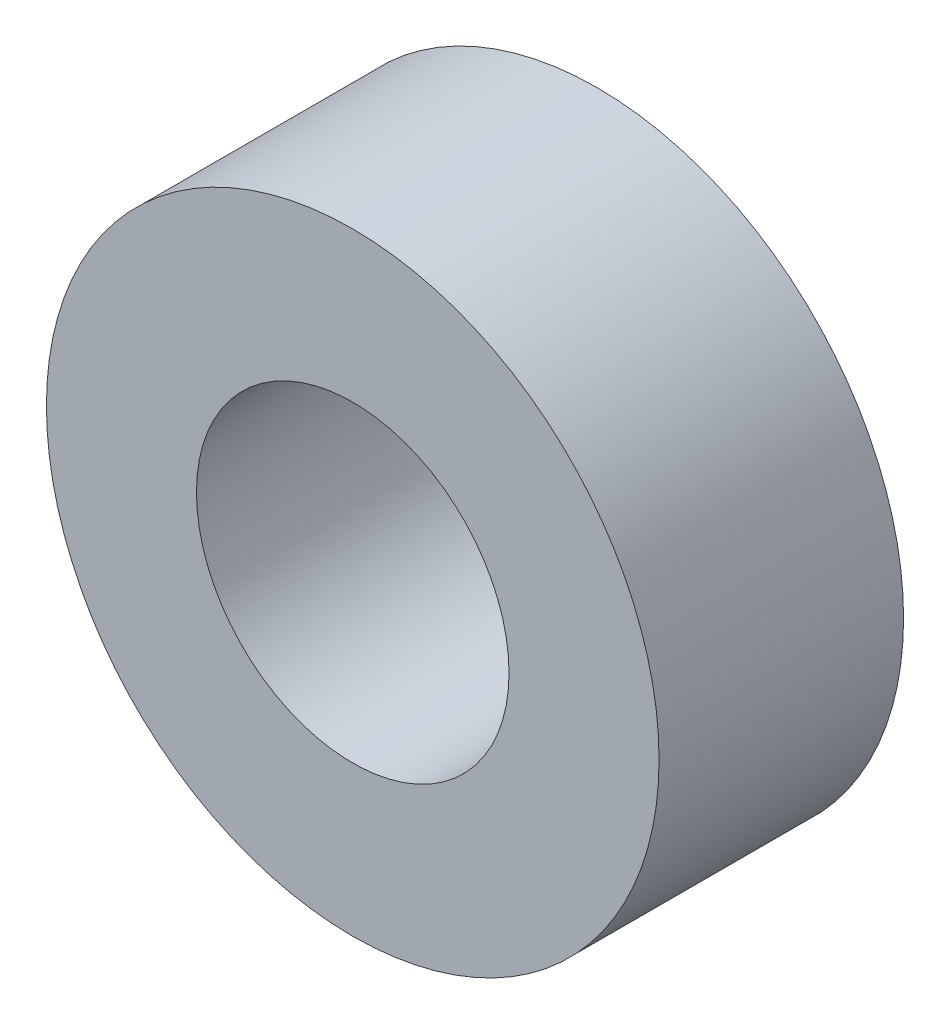
ISO-10303-21;
HEADER;
FILE_DESCRIPTION(('STEP AP214'),'2;1');
FILE_NAME('part.step','',(''),(''),'','','');
FILE_SCHEMA(('AUTOMOTIVE_DESIGN { 1 0 10303 214 1 1 1 1 }'));
ENDSEC;
DATA;
#1=APPLICATION_CONTEXT('core data for automotive mechanical design processes');
#2=APPLICATION_PROTOCOL_DEFINITION('international standard','automotive_design',2000,#1);
#3=PRODUCT_CONTEXT('',#1,'mechanical');
#4=PRODUCT('Part','Part','',(#3));
#5=PRODUCT_RELATED_PRODUCT_CATEGORY('part','',(#4));
#6=PRODUCT_DEFINITION_FORMATION('','',#4);
#7=PRODUCT_DEFINITION_CONTEXT('part definition',#1,'design');
#8=PRODUCT_DEFINITION('design','',#6,#7);
#9=PRODUCT_DEFINITION_SHAPE('','',#8);
#10=(LENGTH_UNIT() NAMED_UNIT(*) SI_UNIT(.MILLI.,.METRE.));
#11=(NAMED_UNIT(*) PLANE_ANGLE_UNIT() SI_UNIT($,.RADIAN.));
#12=(NAMED_UNIT(*) SI_UNIT($,.STERADIAN.) SOLID_ANGLE_UNIT());
#13=UNCERTAINTY_MEASURE_WITH_UNIT(LENGTH_MEASURE(1.E-05),#10,'distance_accuracy_value','');
#14=(GEOMETRIC_REPRESENTATION_CONTEXT(3) GLOBAL_UNCERTAINTY_ASSIGNED_CONTEXT((#13)) GLOBAL_UNIT_ASSIGNED_CONTEXT((#10,
#11,#12)) REPRESENTATION_CONTEXT('',''));
#15=CARTESIAN_POINT('',(0.,0.,0.));
#16=DIRECTION('',(0.,0.,1.));
#17=DIRECTION('',(1.,0.,0.));
#18=AXIS2_PLACEMENT_3D('',#15,#16,#17);
#19=CARTESIAN_POINT('',(0.,0.,7.450808568));
#20=DIRECTION('',(0.,0.,1.));
#21=DIRECTION('',(1.,0.,0.));
#22=AXIS2_PLACEMENT_3D('',#19,#20,#21);
#23=PLANE('',#22);
#24=CARTESIAN_POINT('',(0.,0.,7.450808568));
#25=DIRECTION('',(0.,0.,1.));
#26=DIRECTION('',(1.,0.,0.));
#27=AXIS2_PLACEMENT_3D('',#24,#25,#26);
#28=CIRCLE('',#27,18.669);
#29=CARTESIAN_POINT('',(18.669,0.,7.450808568));
#30=VERTEX_POINT('',#29);
#31=EDGE_CURVE('E12',#30,#30,#28,.T.);
#32=ORIENTED_EDGE('',*,*,#31,.T.);
#33=EDGE_LOOP('',(#32));
#34=FACE_BOUND('',#33,.T.);
#35=CARTESIAN_POINT('',(0.,0.,7.450808568));
#36=DIRECTION('',(0.,0.,1.));
#37=DIRECTION('',(1.,0.,0.));
#38=AXIS2_PLACEMENT_3D('',#35,#36,#37);
#39=CIRCLE('',#38,9.525);
#40=CARTESIAN_POINT('',(9.525,0.,7.450808568));
#41=VERTEX_POINT('',#40);
#42=EDGE_CURVE('E53',#41,#41,#39,.T.);
#43=ORIENTED_EDGE('',*,*,#42,.F.);
#44=EDGE_LOOP('',(#43));
#45=FACE_BOUND('',#44,.T.);
#46=ADVANCED_FACE('F42',(#34,#45),#23,.T.);
#47=CARTESIAN_POINT('',(0.,0.,-7.450808568));
#48=DIRECTION('',(0.,0.,1.));
#49=DIRECTION('',(1.,0.,0.));
#50=AXIS2_PLACEMENT_3D('',#47,#48,#49);
#51=PLANE('',#50);
#52=CARTESIAN_POINT('',(0.,0.,-7.450808568));
#53=DIRECTION('',(0.,0.,1.));
#54=DIRECTION('',(1.,0.,0.));
#55=AXIS2_PLACEMENT_3D('',#52,#53,#54);
#56=CIRCLE('',#55,18.669);
#57=CARTESIAN_POINT('',(18.669,0.,-7.450808568));
#58=VERTEX_POINT('',#57);
#59=EDGE_CURVE('E46',#58,#58,#56,.T.);
#60=ORIENTED_EDGE('',*,*,#59,.F.);
#61=EDGE_LOOP('',(#60));
#62=FACE_BOUND('',#61,.T.);
#63=CARTESIAN_POINT('',(0.,0.,-7.450808568));
#64=DIRECTION('',(0.,0.,1.));
#65=DIRECTION('',(1.,0.,0.));
#66=AXIS2_PLACEMENT_3D('',#63,#64,#65);
#67=CIRCLE('',#66,9.525);
#68=CARTESIAN_POINT('',(9.525,0.,-7.450808568));
#69=VERTEX_POINT('',#68);
#70=EDGE_CURVE('E55',#69,#69,#67,.T.);
#71=ORIENTED_EDGE('',*,*,#70,.T.);
#72=EDGE_LOOP('',(#71));
#73=FACE_BOUND('',#72,.T.);
#74=ADVANCED_FACE('F65',(#62,#73),#51,.F.);
#75=CARTESIAN_POINT('',(0.,0.,7.450808568));
#76=DIRECTION('',(0.,0.,-1.));
#77=DIRECTION('',(-1.,0.,0.));
#78=AXIS2_PLACEMENT_3D('',#75,#76,#77);
#79=CYLINDRICAL_SURFACE('',#78,18.669);
#80=ORIENTED_EDGE('',*,*,#31,.F.);
#81=EDGE_LOOP('',(#80));
#82=FACE_BOUND('',#81,.T.);
#83=ORIENTED_EDGE('',*,*,#59,.T.);
#84=EDGE_LOOP('',(#83));
#85=FACE_BOUND('',#84,.T.);
#86=ADVANCED_FACE('F44',(#82,#85),#79,.T.);
#87=CARTESIAN_POINT('',(0.,0.,7.450808568));
#88=DIRECTION('',(0.,0.,-1.));
#89=DIRECTION('',(-1.,0.,0.));
#90=AXIS2_PLACEMENT_3D('',#87,#88,#89);
#91=CYLINDRICAL_SURFACE('',#90,9.525);
#92=ORIENTED_EDGE('',*,*,#42,.T.);
#93=EDGE_LOOP('',(#92));
#94=FACE_BOUND('',#93,.T.);
#95=ORIENTED_EDGE('',*,*,#70,.F.);
#96=EDGE_LOOP('',(#95));
#97=FACE_BOUND('',#96,.T.);
#98=ADVANCED_FACE('F61',(#94,#97),#91,.F.);
#99=CLOSED_SHELL('',(#46,#74,#86,#98));
#100=MANIFOLD_SOLID_BREP('B2',#99);
#101=ADVANCED_BREP_SHAPE_REPRESENTATION('',(#18,#100),#14);
#102=SHAPE_DEFINITION_REPRESENTATION(#9,#101);
ENDSEC;
END-ISO-10303-21;
